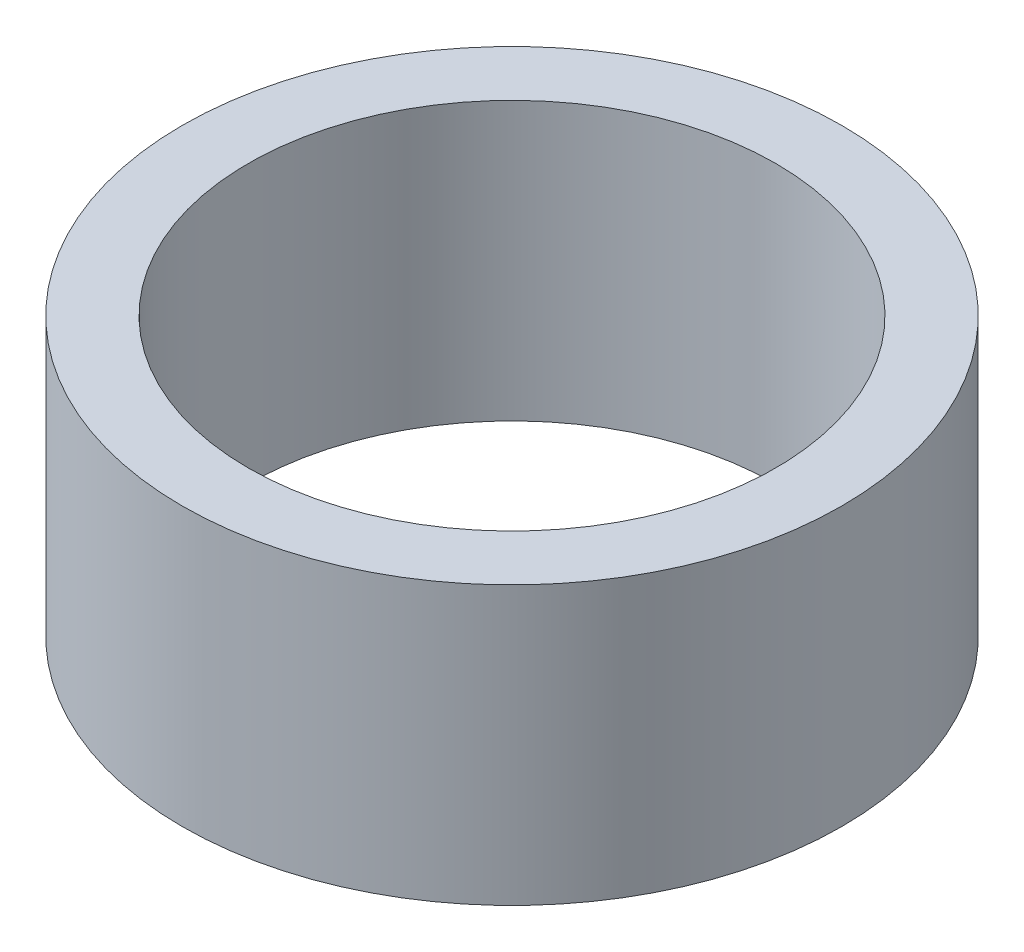
ISO-10303-21;
HEADER;
FILE_DESCRIPTION(('STEP AP214'),'2;1');
FILE_NAME('part.step','',(''),(''),'','','');
FILE_SCHEMA(('AUTOMOTIVE_DESIGN { 1 0 10303 214 1 1 1 1 }'));
ENDSEC;
DATA;
#1=APPLICATION_CONTEXT('core data for automotive mechanical design processes');
#2=APPLICATION_PROTOCOL_DEFINITION('international standard','automotive_design',2000,#1);
#3=PRODUCT_CONTEXT('',#1,'mechanical');
#4=PRODUCT('Part','Part','',(#3));
#5=PRODUCT_RELATED_PRODUCT_CATEGORY('part','',(#4));
#6=PRODUCT_DEFINITION_FORMATION('','',#4);
#7=PRODUCT_DEFINITION_CONTEXT('part definition',#1,'design');
#8=PRODUCT_DEFINITION('design','',#6,#7);
#9=PRODUCT_DEFINITION_SHAPE('','',#8);
#10=(LENGTH_UNIT() NAMED_UNIT(*) SI_UNIT(.MILLI.,.METRE.));
#11=(NAMED_UNIT(*) PLANE_ANGLE_UNIT() SI_UNIT($,.RADIAN.));
#12=(NAMED_UNIT(*) SI_UNIT($,.STERADIAN.) SOLID_ANGLE_UNIT());
#13=UNCERTAINTY_MEASURE_WITH_UNIT(LENGTH_MEASURE(1.E-05),#10,'distance_accuracy_value','');
#14=(GEOMETRIC_REPRESENTATION_CONTEXT(3) GLOBAL_UNCERTAINTY_ASSIGNED_CONTEXT((#13)) GLOBAL_UNIT_ASSIGNED_CONTEXT((#10,
#11,#12)) REPRESENTATION_CONTEXT('',''));
#15=CARTESIAN_POINT('',(0.,0.,0.));
#16=DIRECTION('',(0.,0.,1.));
#17=DIRECTION('',(1.,0.,0.));
#18=AXIS2_PLACEMENT_3D('',#15,#16,#17);
#19=CARTESIAN_POINT('',(0.,25.4,0.));
#20=DIRECTION('',(0.,1.,0.));
#21=DIRECTION('',(0.,0.,1.));
#22=AXIS2_PLACEMENT_3D('',#19,#20,#21);
#23=PLANE('',#22);
#24=CARTESIAN_POINT('',(0.,25.4,0.));
#25=DIRECTION('',(0.,1.,0.));
#26=DIRECTION('',(0.,0.,1.));
#27=AXIS2_PLACEMENT_3D('',#24,#25,#26);
#28=CIRCLE('',#27,30.1625);
#29=CARTESIAN_POINT('',(0.,25.4,30.1625));
#30=VERTEX_POINT('',#29);
#31=EDGE_CURVE('E10',#30,#30,#28,.T.);
#32=ORIENTED_EDGE('',*,*,#31,.T.);
#33=EDGE_LOOP('',(#32));
#34=FACE_BOUND('',#33,.T.);
#35=CARTESIAN_POINT('',(0.,25.4,0.));
#36=DIRECTION('',(0.,1.,0.));
#37=DIRECTION('',(0.,0.,1.));
#38=AXIS2_PLACEMENT_3D('',#35,#36,#37);
#39=CIRCLE('',#38,24.13);
#40=CARTESIAN_POINT('',(0.,25.4,24.13));
#41=VERTEX_POINT('',#40);
#42=EDGE_CURVE('E55',#41,#41,#39,.T.);
#43=ORIENTED_EDGE('',*,*,#42,.F.);
#44=EDGE_LOOP('',(#43));
#45=FACE_BOUND('',#44,.T.);
#46=ADVANCED_FACE('F41',(#34,#45),#23,.T.);
#47=CARTESIAN_POINT('',(0.,0.,0.));
#48=DIRECTION('',(0.,1.,0.));
#49=DIRECTION('',(0.,0.,1.));
#50=AXIS2_PLACEMENT_3D('',#47,#48,#49);
#51=PLANE('',#50);
#52=CARTESIAN_POINT('',(0.,0.,0.));
#53=DIRECTION('',(0.,1.,0.));
#54=DIRECTION('',(0.,0.,1.));
#55=AXIS2_PLACEMENT_3D('',#52,#53,#54);
#56=CIRCLE('',#55,30.1625);
#57=CARTESIAN_POINT('',(0.,0.,30.1625));
#58=VERTEX_POINT('',#57);
#59=EDGE_CURVE('E45',#58,#58,#56,.T.);
#60=ORIENTED_EDGE('',*,*,#59,.F.);
#61=EDGE_LOOP('',(#60));
#62=FACE_BOUND('',#61,.T.);
#63=CARTESIAN_POINT('',(0.,0.,0.));
#64=DIRECTION('',(0.,1.,0.));
#65=DIRECTION('',(0.,0.,1.));
#66=AXIS2_PLACEMENT_3D('',#63,#64,#65);
#67=CIRCLE('',#66,24.13);
#68=CARTESIAN_POINT('',(0.,0.,24.13));
#69=VERTEX_POINT('',#68);
#70=EDGE_CURVE('E57',#69,#69,#67,.T.);
#71=ORIENTED_EDGE('',*,*,#70,.T.);
#72=EDGE_LOOP('',(#71));
#73=FACE_BOUND('',#72,.T.);
#74=ADVANCED_FACE('F68',(#62,#73),#51,.F.);
#75=CARTESIAN_POINT('',(0.,25.4,0.));
#76=DIRECTION('',(0.,-1.,0.));
#77=DIRECTION('',(0.,0.,-1.));
#78=AXIS2_PLACEMENT_3D('',#75,#76,#77);
#79=CYLINDRICAL_SURFACE('',#78,30.1625);
#80=ORIENTED_EDGE('',*,*,#31,.F.);
#81=EDGE_LOOP('',(#80));
#82=FACE_BOUND('',#81,.T.);
#83=ORIENTED_EDGE('',*,*,#59,.T.);
#84=EDGE_LOOP('',(#83));
#85=FACE_BOUND('',#84,.T.);
#86=ADVANCED_FACE('F43',(#82,#85),#79,.T.);
#87=CARTESIAN_POINT('',(0.,25.4,0.));
#88=DIRECTION('',(0.,-1.,0.));
#89=DIRECTION('',(0.,0.,-1.));
#90=AXIS2_PLACEMENT_3D('',#87,#88,#89);
#91=CYLINDRICAL_SURFACE('',#90,24.13);
#92=ORIENTED_EDGE('',*,*,#42,.T.);
#93=EDGE_LOOP('',(#92));
#94=FACE_BOUND('',#93,.T.);
#95=ORIENTED_EDGE('',*,*,#70,.F.);
#96=EDGE_LOOP('',(#95));
#97=FACE_BOUND('',#96,.T.);
#98=ADVANCED_FACE('F64',(#94,#97),#91,.F.);
#99=CLOSED_SHELL('',(#46,#74,#86,#98));
#100=MANIFOLD_SOLID_BREP('B2',#99);
#101=ADVANCED_BREP_SHAPE_REPRESENTATION('',(#18,#100),#14);
#102=SHAPE_DEFINITION_REPRESENTATION(#9,#101);
ENDSEC;
END-ISO-10303-21;
